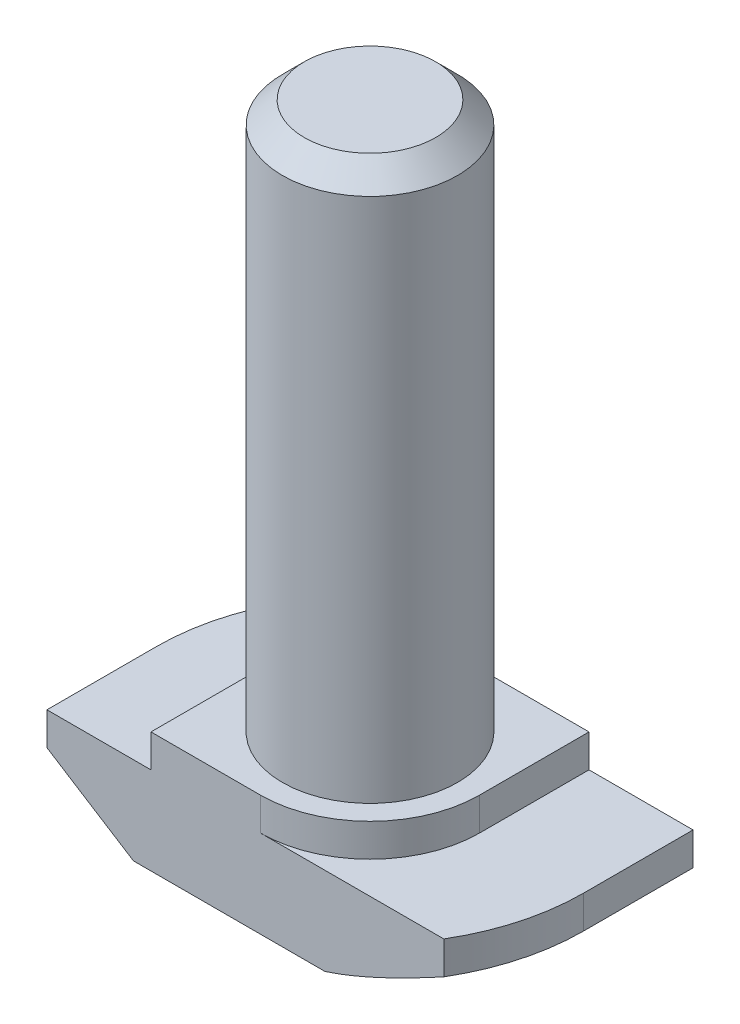
ISO-10303-21;
HEADER;
FILE_DESCRIPTION(('STEP AP214'),'2;1');
FILE_NAME('part.step','',(''),(''),'','','');
FILE_SCHEMA(('AUTOMOTIVE_DESIGN { 1 0 10303 214 1 1 1 1 }'));
ENDSEC;
DATA;
#1=APPLICATION_CONTEXT('core data for automotive mechanical design processes');
#2=APPLICATION_PROTOCOL_DEFINITION('international standard','automotive_design',2000,#1);
#3=PRODUCT_CONTEXT('',#1,'mechanical');
#4=PRODUCT('Part','Part','',(#3));
#5=PRODUCT_RELATED_PRODUCT_CATEGORY('part','',(#4));
#6=PRODUCT_DEFINITION_FORMATION('','',#4);
#7=PRODUCT_DEFINITION_CONTEXT('part definition',#1,'design');
#8=PRODUCT_DEFINITION('design','',#6,#7);
#9=PRODUCT_DEFINITION_SHAPE('','',#8);
#10=(LENGTH_UNIT() NAMED_UNIT(*) SI_UNIT(.MILLI.,.METRE.));
#11=(NAMED_UNIT(*) PLANE_ANGLE_UNIT() SI_UNIT($,.RADIAN.));
#12=(NAMED_UNIT(*) SI_UNIT($,.STERADIAN.) SOLID_ANGLE_UNIT());
#13=UNCERTAINTY_MEASURE_WITH_UNIT(LENGTH_MEASURE(1.E-05),#10,'distance_accuracy_value','');
#14=(GEOMETRIC_REPRESENTATION_CONTEXT(3) GLOBAL_UNCERTAINTY_ASSIGNED_CONTEXT((#13)) GLOBAL_UNIT_ASSIGNED_CONTEXT((#10,
#11,#12)) REPRESENTATION_CONTEXT('',''));
#15=CARTESIAN_POINT('',(0.,0.,0.));
#16=DIRECTION('',(0.,0.,1.));
#17=DIRECTION('',(1.,0.,0.));
#18=AXIS2_PLACEMENT_3D('',#15,#16,#17);
#19=CARTESIAN_POINT('',(-9.75,0.,5.));
#20=DIRECTION('',(1.,0.,0.));
#21=DIRECTION('',(0.,0.,-1.));
#22=AXIS2_PLACEMENT_3D('',#19,#20,#21);
#23=PLANE('',#22);
#24=DIRECTION('',(0.,0.,-1.));
#25=VECTOR('',#24,1.);
#26=CARTESIAN_POINT('',(-9.75,2.5,5.));
#27=LINE('',#26,#25);
#28=CARTESIAN_POINT('',(-9.75,2.5,5.));
#29=VERTEX_POINT('',#28);
#30=CARTESIAN_POINT('',(-9.75,2.5,0.));
#31=VERTEX_POINT('',#30);
#32=EDGE_CURVE('E372',#29,#31,#27,.T.);
#33=ORIENTED_EDGE('',*,*,#32,.F.);
#34=DIRECTION('',(0.,-1.,0.));
#35=VECTOR('',#34,1.);
#36=CARTESIAN_POINT('',(-9.75,0.,5.));
#37=LINE('',#36,#35);
#38=CARTESIAN_POINT('',(-9.75,4.,5.));
#39=VERTEX_POINT('',#38);
#40=EDGE_CURVE('E209',#39,#29,#37,.T.);
#41=ORIENTED_EDGE('',*,*,#40,.F.);
#42=DIRECTION('',(0.,0.,-1.));
#43=VECTOR('',#42,1.);
#44=CARTESIAN_POINT('',(-9.75,4.,5.));
#45=LINE('',#44,#43);
#46=CARTESIAN_POINT('',(-9.75,4.,0.));
#47=VERTEX_POINT('',#46);
#48=EDGE_CURVE('E224',#39,#47,#45,.T.);
#49=ORIENTED_EDGE('',*,*,#48,.T.);
#50=DIRECTION('',(0.,1.,0.));
#51=VECTOR('',#50,1.);
#52=CARTESIAN_POINT('',(-9.75,0.,0.));
#53=LINE('',#52,#51);
#54=EDGE_CURVE('E190',#31,#47,#53,.T.);
#55=ORIENTED_EDGE('',*,*,#54,.F.);
#56=EDGE_LOOP('',(#33,#41,#49,#55));
#57=FACE_BOUND('',#56,.T.);
#58=ADVANCED_FACE('F37',(#57),#23,.F.);
#59=CARTESIAN_POINT('',(9.75,0.,5.));
#60=DIRECTION('',(0.,1.,0.));
#61=DIRECTION('',(0.,0.,1.));
#62=AXIS2_PLACEMENT_3D('',#59,#60,#61);
#63=PLANE('',#62);
#64=DIRECTION('',(1.,0.,0.));
#65=VECTOR('',#64,1.);
#66=CARTESIAN_POINT('',(9.75,0.,5.));
#67=LINE('',#66,#65);
#68=CARTESIAN_POINT('',(-5.8,0.,5.));
#69=VERTEX_POINT('',#68);
#70=CARTESIAN_POINT('',(2.93938769133981,0.,5.));
#71=VERTEX_POINT('',#70);
#72=EDGE_CURVE('E212',#69,#71,#67,.T.);
#73=ORIENTED_EDGE('',*,*,#72,.F.);
#74=DIRECTION('',(0.,0.,-1.));
#75=VECTOR('',#74,1.);
#76=CARTESIAN_POINT('',(-5.8,0.,5.));
#77=LINE('',#76,#75);
#78=CARTESIAN_POINT('',(-5.8,0.,0.));
#79=VERTEX_POINT('',#78);
#80=EDGE_CURVE('E375',#69,#79,#77,.T.);
#81=ORIENTED_EDGE('',*,*,#80,.T.);
#82=CARTESIAN_POINT('',(0.,0.,0.));
#83=DIRECTION('',(0.,-1.,0.));
#84=DIRECTION('',(-1.,0.,0.));
#85=AXIS2_PLACEMENT_3D('',#82,#83,#84);
#86=CIRCLE('',#85,5.8);
#87=CARTESIAN_POINT('',(-2.93938769133982,0.,-5.));
#88=VERTEX_POINT('',#87);
#89=EDGE_CURVE('E385',#79,#88,#86,.T.);
#90=ORIENTED_EDGE('',*,*,#89,.T.);
#91=DIRECTION('',(1.,0.,0.));
#92=VECTOR('',#91,1.);
#93=CARTESIAN_POINT('',(9.75,0.,-5.));
#94=LINE('',#93,#92);
#95=CARTESIAN_POINT('',(5.8,0.,-5.));
#96=VERTEX_POINT('',#95);
#97=EDGE_CURVE('E208',#88,#96,#94,.T.);
#98=ORIENTED_EDGE('',*,*,#97,.T.);
#99=DIRECTION('',(0.,0.,1.));
#100=VECTOR('',#99,1.);
#101=CARTESIAN_POINT('',(5.8,0.,-9.75));
#102=LINE('',#101,#100);
#103=CARTESIAN_POINT('',(5.8,0.,0.));
#104=VERTEX_POINT('',#103);
#105=EDGE_CURVE('E53',#96,#104,#102,.T.);
#106=ORIENTED_EDGE('',*,*,#105,.T.);
#107=CARTESIAN_POINT('',(0.,0.,0.));
#108=DIRECTION('',(0.,-1.,0.));
#109=DIRECTION('',(1.,0.,0.));
#110=AXIS2_PLACEMENT_3D('',#107,#108,#109);
#111=CIRCLE('',#110,5.8);
#112=EDGE_CURVE('E153',#104,#71,#111,.T.);
#113=ORIENTED_EDGE('',*,*,#112,.T.);
#114=EDGE_LOOP('',(#73,#81,#90,#98,#106,#113));
#115=FACE_BOUND('',#114,.T.);
#116=ADVANCED_FACE('F270',(#115),#63,.F.);
#117=CARTESIAN_POINT('',(9.75,0.,5.));
#118=DIRECTION('',(-1.,0.,0.));
#119=DIRECTION('',(0.,0.,1.));
#120=AXIS2_PLACEMENT_3D('',#117,#118,#119);
#121=PLANE('',#120);
#122=DIRECTION('',(0.,0.,1.));
#123=VECTOR('',#122,1.);
#124=CARTESIAN_POINT('',(9.75,2.5,-9.75));
#125=LINE('',#124,#123);
#126=CARTESIAN_POINT('',(9.75,2.5,-5.));
#127=VERTEX_POINT('',#126);
#128=CARTESIAN_POINT('',(9.75,2.5,0.));
#129=VERTEX_POINT('',#128);
#130=EDGE_CURVE('E145',#127,#129,#125,.T.);
#131=ORIENTED_EDGE('',*,*,#130,.F.);
#132=DIRECTION('',(0.,1.,0.));
#133=VECTOR('',#132,1.);
#134=CARTESIAN_POINT('',(9.75,0.,-5.));
#135=LINE('',#134,#133);
#136=CARTESIAN_POINT('',(9.75,4.,-5.));
#137=VERTEX_POINT('',#136);
#138=EDGE_CURVE('E227',#127,#137,#135,.T.);
#139=ORIENTED_EDGE('',*,*,#138,.T.);
#140=DIRECTION('',(0.,0.,-1.));
#141=VECTOR('',#140,1.);
#142=CARTESIAN_POINT('',(9.75,4.,5.));
#143=LINE('',#142,#141);
#144=CARTESIAN_POINT('',(9.75,4.,0.));
#145=VERTEX_POINT('',#144);
#146=EDGE_CURVE('E173',#145,#137,#143,.T.);
#147=ORIENTED_EDGE('',*,*,#146,.F.);
#148=DIRECTION('',(0.,1.,0.));
#149=VECTOR('',#148,1.);
#150=CARTESIAN_POINT('',(9.75,0.,0.));
#151=LINE('',#150,#149);
#152=EDGE_CURVE('E166',#129,#145,#151,.T.);
#153=ORIENTED_EDGE('',*,*,#152,.F.);
#154=EDGE_LOOP('',(#131,#139,#147,#153));
#155=FACE_BOUND('',#154,.T.);
#156=ADVANCED_FACE('F171',(#155),#121,.F.);
#157=CARTESIAN_POINT('',(0.,0.,5.));
#158=DIRECTION('',(0.,0.,-1.));
#159=DIRECTION('',(-1.,0.,0.));
#160=AXIS2_PLACEMENT_3D('',#157,#158,#159);
#161=PLANE('',#160);
#162=DIRECTION('',(-0.844980197489509,0.534797593347791,0.));
#163=VECTOR('',#162,1.);
#164=CARTESIAN_POINT('',(-9.75,2.5,5.));
#165=LINE('',#164,#163);
#166=EDGE_CURVE('E373',#69,#29,#165,.T.);
#167=ORIENTED_EDGE('',*,*,#166,.F.);
#168=ORIENTED_EDGE('',*,*,#72,.T.);
#169=CARTESIAN_POINT('',(8.3710345213916,2.50038035044416,5.));
#170=CARTESIAN_POINT('',(8.14485503763147,2.37751255056509,5.));
#171=CARTESIAN_POINT('',(7.91814414436424,2.25560825185528,5.));
#172=CARTESIAN_POINT('',(7.46336802856226,2.01427419874183,5.));
#173=CARTESIAN_POINT('',(7.23530261352057,1.89484480745523,5.));
#174=CARTESIAN_POINT('',(6.77658273225198,1.65852444966252,5.));
#175=CARTESIAN_POINT('',(6.54592128446781,1.54164699581211,5.));
#176=CARTESIAN_POINT('',(6.08267383878011,1.31178770374963,5.));
#177=CARTESIAN_POINT('',(5.85008793878494,1.19880566884712,5.));
#178=CARTESIAN_POINT('',(5.38850045895099,0.980602867779513,5.));
#179=CARTESIAN_POINT('',(5.1595578408824,0.875257869563463,5.));
#180=CARTESIAN_POINT('',(4.69895239023341,0.670592548807996,5.));
#181=CARTESIAN_POINT('',(4.46728928872485,0.571272827972461,5.));
#182=CARTESIAN_POINT('',(4.00108707979834,0.38059166900738,5.));
#183=CARTESIAN_POINT('',(3.76655273287754,0.289218677543095,5.));
#184=CARTESIAN_POINT('',(3.29379614776259,0.116644148005836,5.));
#185=CARTESIAN_POINT('',(3.05557490729072,0.0354399103972046,5.));
#186=CARTESIAN_POINT('',(2.58854667138869,-0.109582099168053,5.));
#187=CARTESIAN_POINT('',(2.35996631966938,-0.174122082532671,5.));
#188=CARTESIAN_POINT('',(1.89919260818542,-0.288382603381046,5.));
#189=CARTESIAN_POINT('',(1.66700173473846,-0.33811290172539,5.));
#190=CARTESIAN_POINT('',(1.31509928874305,-0.399489564391158,5.));
#191=CARTESIAN_POINT('',(1.19653459621012,-0.417808799856712,5.));
#192=CARTESIAN_POINT('',(0.958746309721246,-0.449516897628666,5.));
#193=CARTESIAN_POINT('',(0.839522754036867,-0.462906043317658,5.));
#194=CARTESIAN_POINT('',(0.600273143638718,-0.484487035929079,5.));
#195=CARTESIAN_POINT('',(0.480245784105953,-0.492664504258673,5.));
#196=CARTESIAN_POINT('',(0.239914647066935,-0.50360257514633,5.));
#197=CARTESIAN_POINT('',(0.119610806307569,-0.506361781459069,5.));
#198=CARTESIAN_POINT('',(-0.000700000000000271,-0.506329082911393,5.));
#199=B_SPLINE_CURVE_WITH_KNOTS('',3,(#169,#170,#171,#172,#173,#174,#175,#176,#177,#178,#179,
#180,#181,#182,#183,#184,#185,#186,#187,#188,#189,#190,#191,#192,#193,#194,#195,#196,#197,#198),
.UNSPECIFIED.,.F.,.F.,(4,2,2,2,2,2,2,2,2,2,2,2,2,2,4),(0.,0.772201750738158,1.54451600760777,
2.32023520866627,3.09591518399236,3.85189775311528,4.60795569327251,5.36289539506572,
6.1176342534965,6.82981297940338,7.54152127390794,7.90134934767844,8.26115673522602,
8.62195255315834,8.98284133326183),.UNSPECIFIED.);
#200=CARTESIAN_POINT('',(8.3703345213916,2.5,5.));
#201=VERTEX_POINT('',#200);
#202=EDGE_CURVE('E318',#201,#71,#199,.T.);
#203=ORIENTED_EDGE('',*,*,#202,.F.);
#204=DIRECTION('',(0.,1.,0.));
#205=VECTOR('',#204,1.);
#206=CARTESIAN_POINT('',(8.3703345213916,0.,5.));
#207=LINE('',#206,#205);
#208=CARTESIAN_POINT('',(8.3703345213916,4.,5.));
#209=VERTEX_POINT('',#208);
#210=EDGE_CURVE('E168',#201,#209,#207,.T.);
#211=ORIENTED_EDGE('',*,*,#210,.T.);
#212=DIRECTION('',(-1.,0.,0.));
#213=VECTOR('',#212,1.);
#214=CARTESIAN_POINT('',(9.75,4.,5.));
#215=LINE('',#214,#213);
#216=CARTESIAN_POINT('',(0.,4.,5.));
#217=VERTEX_POINT('',#216);
#218=EDGE_CURVE('E216',#209,#217,#215,.T.);
#219=ORIENTED_EDGE('',*,*,#218,.T.);
#220=DIRECTION('',(0.,1.,0.));
#221=VECTOR('',#220,1.);
#222=CARTESIAN_POINT('',(0.,-3.07106781186548,5.));
#223=LINE('',#222,#221);
#224=CARTESIAN_POINT('',(0.,5.5,5.));
#225=VERTEX_POINT('',#224);
#226=EDGE_CURVE('E194',#217,#225,#223,.T.);
#227=ORIENTED_EDGE('',*,*,#226,.T.);
#228=DIRECTION('',(-1.,0.,0.));
#229=VECTOR('',#228,1.);
#230=CARTESIAN_POINT('',(-5.,5.5,5.));
#231=LINE('',#230,#229);
#232=CARTESIAN_POINT('',(-5.,5.5,5.));
#233=VERTEX_POINT('',#232);
#234=EDGE_CURVE('E218',#225,#233,#231,.T.);
#235=ORIENTED_EDGE('',*,*,#234,.T.);
#236=DIRECTION('',(0.,-1.,0.));
#237=VECTOR('',#236,1.);
#238=CARTESIAN_POINT('',(-5.,4.,5.));
#239=LINE('',#238,#237);
#240=CARTESIAN_POINT('',(-5.,4.,5.));
#241=VERTEX_POINT('',#240);
#242=EDGE_CURVE('E220',#233,#241,#239,.T.);
#243=ORIENTED_EDGE('',*,*,#242,.T.);
#244=DIRECTION('',(-1.,0.,0.));
#245=VECTOR('',#244,1.);
#246=CARTESIAN_POINT('',(-9.75,4.,5.));
#247=LINE('',#246,#245);
#248=EDGE_CURVE('E222',#241,#39,#247,.T.);
#249=ORIENTED_EDGE('',*,*,#248,.T.);
#250=ORIENTED_EDGE('',*,*,#40,.T.);
#251=EDGE_LOOP('',(#167,#168,#203,#211,#219,#227,#235,#243,#249,#250));
#252=FACE_BOUND('',#251,.T.);
#253=ADVANCED_FACE('F281',(#252),#161,.F.);
#254=CARTESIAN_POINT('',(0.,0.,-5.));
#255=DIRECTION('',(0.,0.,-1.));
#256=DIRECTION('',(-1.,0.,0.));
#257=AXIS2_PLACEMENT_3D('',#254,#255,#256);
#258=PLANE('',#257);
#259=ORIENTED_EDGE('',*,*,#97,.F.);
#260=CARTESIAN_POINT('',(0.00070000000000138,-0.506329082911397,-5.));
#261=CARTESIAN_POINT('',(-0.11492355286762,-0.506358201187866,-5.));
#262=CARTESIAN_POINT('',(-0.230541342283267,-0.503811651701555,-5.));
#263=CARTESIAN_POINT('',(-0.461532910337905,-0.493707507103407,-5.));
#264=CARTESIAN_POINT('',(-0.576906737550149,-0.48615102719651,-5.));
#265=CARTESIAN_POINT('',(-0.806948113963408,-0.466191618236643,-5.));
#266=CARTESIAN_POINT('',(-0.921616700128454,-0.453800577810883,-5.));
#267=CARTESIAN_POINT('',(-1.15036260798101,-0.424427750820964,-5.));
#268=CARTESIAN_POINT('',(-1.26443990025042,-0.407445738038838,-5.));
#269=CARTESIAN_POINT('',(-1.60314096911344,-0.350479262852961,-5.));
#270=CARTESIAN_POINT('',(-1.82673025128966,-0.304244681434307,-5.));
#271=CARTESIAN_POINT('',(-2.27058382288403,-0.197749704270996,-5.));
#272=CARTESIAN_POINT('',(-2.49084621805169,-0.13748161665558,-5.));
#273=CARTESIAN_POINT('',(-2.95448552535975,0.00231900980771354,-5.));
#274=CARTESIAN_POINT('',(-3.19742086780124,0.0833022458753652,-5.));
#275=CARTESIAN_POINT('',(-3.67941522891594,0.256156738222036,-5.));
#276=CARTESIAN_POINT('',(-3.91847303773159,0.348031321223873,-5.));
#277=CARTESIAN_POINT('',(-4.39361886594961,0.540256398970149,-5.));
#278=CARTESIAN_POINT('',(-4.62970092868475,0.640621503905241,-5.));
#279=CARTESIAN_POINT('',(-5.09899519125866,0.847741673465407,-5.));
#280=CARTESIAN_POINT('',(-5.33220771380245,0.95449601149878,-5.));
#281=CARTESIAN_POINT('',(-5.80260552399803,1.17594489337857,-5.));
#282=CARTESIAN_POINT('',(-6.0397260114898,1.29077650765228,-5.));
#283=CARTESIAN_POINT('',(-6.51194869465368,1.52453629386533,-5.));
#284=CARTESIAN_POINT('',(-6.74705077660686,1.6434646947539,-5.));
#285=CARTESIAN_POINT('',(-7.21442387447975,1.88395034865552,-5.));
#286=CARTESIAN_POINT('',(-7.44670315486301,2.00549158860828,-5.));
#287=CARTESIAN_POINT('',(-7.90984974140112,2.25114994882745,-5.));
#288=CARTESIAN_POINT('',(-8.14071726576929,2.37526665727356,-5.));
#289=CARTESIAN_POINT('',(-8.3710345213916,2.50038035044416,-5.));
#290=B_SPLINE_CURVE_WITH_KNOTS('',3,(#260,#261,#262,#263,#264,#265,#266,#267,#268,#269,#270,
#271,#272,#273,#274,#275,#276,#277,#278,#279,#280,#281,#282,#283,#284,#285,#286,#287,#288,#289),
.UNSPECIFIED.,.F.,.F.,(4,2,2,2,2,2,2,2,2,2,2,2,2,2,4),(0.,0.346832601073218,0.693588023504655,
1.03949606304986,1.38542115015583,2.06977108877902,2.75449701140492,3.52238142993095,
4.29050100328089,5.05997031676438,5.82935229087948,6.61968962937037,7.41007120780528,
8.19652251048066,8.98284901326047),.UNSPECIFIED.);
#291=CARTESIAN_POINT('',(-8.3703345213916,2.5,-5.));
#292=VERTEX_POINT('',#291);
#293=EDGE_CURVE('E312',#88,#292,#290,.T.);
#294=ORIENTED_EDGE('',*,*,#293,.T.);
#295=DIRECTION('',(0.,1.,0.));
#296=VECTOR('',#295,1.);
#297=CARTESIAN_POINT('',(-8.3703345213916,0.,-5.));
#298=LINE('',#297,#296);
#299=CARTESIAN_POINT('',(-8.3703345213916,4.,-5.));
#300=VERTEX_POINT('',#299);
#301=EDGE_CURVE('E177',#292,#300,#298,.T.);
#302=ORIENTED_EDGE('',*,*,#301,.T.);
#303=DIRECTION('',(-1.,0.,0.));
#304=VECTOR('',#303,1.);
#305=CARTESIAN_POINT('',(-9.75,4.,-5.));
#306=LINE('',#305,#304);
#307=CARTESIAN_POINT('',(0.,4.,-5.));
#308=VERTEX_POINT('',#307);
#309=EDGE_CURVE('E213',#308,#300,#306,.T.);
#310=ORIENTED_EDGE('',*,*,#309,.F.);
#311=DIRECTION('',(0.,1.,0.));
#312=VECTOR('',#311,1.);
#313=CARTESIAN_POINT('',(0.,-3.07106781186548,-5.));
#314=LINE('',#313,#312);
#315=CARTESIAN_POINT('',(0.,5.5,-5.));
#316=VERTEX_POINT('',#315);
#317=EDGE_CURVE('E204',#308,#316,#314,.T.);
#318=ORIENTED_EDGE('',*,*,#317,.T.);
#319=DIRECTION('',(-1.,0.,0.));
#320=VECTOR('',#319,1.);
#321=CARTESIAN_POINT('',(-5.,5.5,-5.));
#322=LINE('',#321,#320);
#323=CARTESIAN_POINT('',(5.,5.5,-5.));
#324=VERTEX_POINT('',#323);
#325=EDGE_CURVE('E235',#324,#316,#322,.T.);
#326=ORIENTED_EDGE('',*,*,#325,.F.);
#327=DIRECTION('',(0.,1.,0.));
#328=VECTOR('',#327,1.);
#329=CARTESIAN_POINT('',(5.,4.,-5.));
#330=LINE('',#329,#328);
#331=CARTESIAN_POINT('',(5.,4.,-5.));
#332=VERTEX_POINT('',#331);
#333=EDGE_CURVE('E232',#332,#324,#330,.T.);
#334=ORIENTED_EDGE('',*,*,#333,.F.);
#335=DIRECTION('',(-1.,0.,0.));
#336=VECTOR('',#335,1.);
#337=CARTESIAN_POINT('',(9.75,4.,-5.));
#338=LINE('',#337,#336);
#339=EDGE_CURVE('E229',#137,#332,#338,.T.);
#340=ORIENTED_EDGE('',*,*,#339,.F.);
#341=ORIENTED_EDGE('',*,*,#138,.F.);
#342=DIRECTION('',(-0.84498019748951,-0.534797593347791,0.));
#343=VECTOR('',#342,1.);
#344=CARTESIAN_POINT('',(1.65884910193342,-2.6209815810548,-5.));
#345=LINE('',#344,#343);
#346=EDGE_CURVE('E149',#127,#96,#345,.T.);
#347=ORIENTED_EDGE('',*,*,#346,.T.);
#348=EDGE_LOOP('',(#259,#294,#302,#310,#318,#326,#334,#340,#341,#347));
#349=FACE_BOUND('',#348,.T.);
#350=ADVANCED_FACE('F303',(#349),#258,.T.);
#351=CARTESIAN_POINT('',(0.,0.,0.));
#352=DIRECTION('',(0.,1.,0.));
#353=DIRECTION('',(0.,0.,1.));
#354=AXIS2_PLACEMENT_3D('',#351,#352,#353);
#355=CYLINDRICAL_SURFACE('',#354,9.75);
#356=CARTESIAN_POINT('',(0.,2.5,0.));
#357=DIRECTION('',(0.,-1.,0.));
#358=DIRECTION('',(-1.,0.,0.));
#359=AXIS2_PLACEMENT_3D('',#356,#357,#358);
#360=CIRCLE('',#359,9.75);
#361=EDGE_CURVE('E61',#31,#292,#360,.T.);
#362=ORIENTED_EDGE('',*,*,#361,.F.);
#363=ORIENTED_EDGE('',*,*,#54,.T.);
#364=CARTESIAN_POINT('',(0.,4.,0.));
#365=DIRECTION('',(0.,-1.,0.));
#366=DIRECTION('',(0.,0.,-1.));
#367=AXIS2_PLACEMENT_3D('',#364,#365,#366);
#368=CIRCLE('',#367,9.75);
#369=EDGE_CURVE('E174',#47,#300,#368,.T.);
#370=ORIENTED_EDGE('',*,*,#369,.T.);
#371=ORIENTED_EDGE('',*,*,#301,.F.);
#372=EDGE_LOOP('',(#362,#363,#370,#371));
#373=FACE_BOUND('',#372,.T.);
#374=ADVANCED_FACE('F307',(#373),#355,.T.);
#375=CARTESIAN_POINT('',(0.,0.,0.));
#376=DIRECTION('',(0.,1.,0.));
#377=DIRECTION('',(0.,0.,1.));
#378=AXIS2_PLACEMENT_3D('',#375,#376,#377);
#379=CYLINDRICAL_SURFACE('',#378,9.75);
#380=CARTESIAN_POINT('',(0.,2.5,0.));
#381=DIRECTION('',(0.,-1.,0.));
#382=DIRECTION('',(1.,0.,0.));
#383=AXIS2_PLACEMENT_3D('',#380,#381,#382);
#384=CIRCLE('',#383,9.75);
#385=EDGE_CURVE('E158',#129,#201,#384,.T.);
#386=ORIENTED_EDGE('',*,*,#385,.F.);
#387=ORIENTED_EDGE('',*,*,#152,.T.);
#388=CARTESIAN_POINT('',(0.,4.,0.));
#389=DIRECTION('',(0.,-1.,0.));
#390=DIRECTION('',(0.,0.,-1.));
#391=AXIS2_PLACEMENT_3D('',#388,#389,#390);
#392=CIRCLE('',#391,9.75);
#393=EDGE_CURVE('E179',#145,#209,#392,.T.);
#394=ORIENTED_EDGE('',*,*,#393,.T.);
#395=ORIENTED_EDGE('',*,*,#210,.F.);
#396=EDGE_LOOP('',(#386,#387,#394,#395));
#397=FACE_BOUND('',#396,.T.);
#398=ADVANCED_FACE('F164',(#397),#379,.T.);
#399=CARTESIAN_POINT('',(-5.,5.5,5.));
#400=DIRECTION('',(0.,-1.,0.));
#401=DIRECTION('',(0.,0.,-1.));
#402=AXIS2_PLACEMENT_3D('',#399,#400,#401);
#403=PLANE('',#402);
#404=CARTESIAN_POINT('',(0.,5.5,0.));
#405=DIRECTION('',(0.,1.,0.));
#406=DIRECTION('',(0.,0.,1.));
#407=AXIS2_PLACEMENT_3D('',#404,#405,#406);
#408=CIRCLE('',#407,4.);
#409=CARTESIAN_POINT('',(0.,5.5,4.));
#410=VERTEX_POINT('',#409);
#411=EDGE_CURVE('E184',#410,#410,#408,.T.);
#412=ORIENTED_EDGE('',*,*,#411,.F.);
#413=EDGE_LOOP('',(#412));
#414=FACE_BOUND('',#413,.T.);
#415=ORIENTED_EDGE('',*,*,#234,.F.);
#416=CARTESIAN_POINT('',(0.,5.5,0.));
#417=DIRECTION('',(0.,-1.,0.));
#418=DIRECTION('',(0.,0.,-1.));
#419=AXIS2_PLACEMENT_3D('',#416,#417,#418);
#420=CIRCLE('',#419,5.);
#421=CARTESIAN_POINT('',(5.,5.5,0.));
#422=VERTEX_POINT('',#421);
#423=EDGE_CURVE('E187',#422,#225,#420,.T.);
#424=ORIENTED_EDGE('',*,*,#423,.F.);
#425=DIRECTION('',(0.,0.,-1.));
#426=VECTOR('',#425,1.);
#427=CARTESIAN_POINT('',(5.,5.5,5.));
#428=LINE('',#427,#426);
#429=EDGE_CURVE('E248',#422,#324,#428,.T.);
#430=ORIENTED_EDGE('',*,*,#429,.T.);
#431=ORIENTED_EDGE('',*,*,#325,.T.);
#432=CARTESIAN_POINT('',(0.,5.5,0.));
#433=DIRECTION('',(0.,-1.,0.));
#434=DIRECTION('',(0.,0.,-1.));
#435=AXIS2_PLACEMENT_3D('',#432,#433,#434);
#436=CIRCLE('',#435,5.);
#437=CARTESIAN_POINT('',(-5.,5.5,0.));
#438=VERTEX_POINT('',#437);
#439=EDGE_CURVE('E198',#438,#316,#436,.T.);
#440=ORIENTED_EDGE('',*,*,#439,.F.);
#441=DIRECTION('',(0.,0.,-1.));
#442=VECTOR('',#441,1.);
#443=CARTESIAN_POINT('',(-5.,5.5,5.));
#444=LINE('',#443,#442);
#445=EDGE_CURVE('E245',#233,#438,#444,.T.);
#446=ORIENTED_EDGE('',*,*,#445,.F.);
#447=EDGE_LOOP('',(#415,#424,#430,#431,#440,#446));
#448=FACE_BOUND('',#447,.T.);
#449=ADVANCED_FACE('F286',(#414,#448),#403,.F.);
#450=CARTESIAN_POINT('',(9.75,4.,5.));
#451=DIRECTION('',(0.,-1.,0.));
#452=DIRECTION('',(0.,0.,-1.));
#453=AXIS2_PLACEMENT_3D('',#450,#451,#452);
#454=PLANE('',#453);
#455=ORIENTED_EDGE('',*,*,#218,.F.);
#456=ORIENTED_EDGE('',*,*,#393,.F.);
#457=ORIENTED_EDGE('',*,*,#146,.T.);
#458=ORIENTED_EDGE('',*,*,#339,.T.);
#459=DIRECTION('',(0.,0.,-1.));
#460=VECTOR('',#459,1.);
#461=CARTESIAN_POINT('',(5.,4.,5.));
#462=LINE('',#461,#460);
#463=CARTESIAN_POINT('',(5.,4.,0.));
#464=VERTEX_POINT('',#463);
#465=EDGE_CURVE('E250',#464,#332,#462,.T.);
#466=ORIENTED_EDGE('',*,*,#465,.F.);
#467=CARTESIAN_POINT('',(0.,4.,0.));
#468=DIRECTION('',(0.,-1.,0.));
#469=DIRECTION('',(0.,0.,-1.));
#470=AXIS2_PLACEMENT_3D('',#467,#468,#469);
#471=CIRCLE('',#470,5.);
#472=EDGE_CURVE('E191',#464,#217,#471,.T.);
#473=ORIENTED_EDGE('',*,*,#472,.T.);
#474=EDGE_LOOP('',(#455,#456,#457,#458,#466,#473));
#475=FACE_BOUND('',#474,.T.);
#476=ADVANCED_FACE('F282',(#475),#454,.F.);
#477=CARTESIAN_POINT('',(5.,4.,5.));
#478=DIRECTION('',(-1.,0.,0.));
#479=DIRECTION('',(0.,0.,1.));
#480=AXIS2_PLACEMENT_3D('',#477,#478,#479);
#481=PLANE('',#480);
#482=ORIENTED_EDGE('',*,*,#429,.F.);
#483=DIRECTION('',(0.,1.,0.));
#484=VECTOR('',#483,1.);
#485=CARTESIAN_POINT('',(5.,-3.07106781186548,0.));
#486=LINE('',#485,#484);
#487=EDGE_CURVE('E189',#464,#422,#486,.T.);
#488=ORIENTED_EDGE('',*,*,#487,.F.);
#489=ORIENTED_EDGE('',*,*,#465,.T.);
#490=ORIENTED_EDGE('',*,*,#333,.T.);
#491=EDGE_LOOP('',(#482,#488,#489,#490));
#492=FACE_BOUND('',#491,.T.);
#493=ADVANCED_FACE('F285',(#492),#481,.F.);
#494=CARTESIAN_POINT('',(-5.,4.,5.));
#495=DIRECTION('',(1.,0.,0.));
#496=DIRECTION('',(0.,0.,-1.));
#497=AXIS2_PLACEMENT_3D('',#494,#495,#496);
#498=PLANE('',#497);
#499=ORIENTED_EDGE('',*,*,#445,.T.);
#500=DIRECTION('',(0.,1.,0.));
#501=VECTOR('',#500,1.);
#502=CARTESIAN_POINT('',(-5.,-3.07106781186548,0.));
#503=LINE('',#502,#501);
#504=CARTESIAN_POINT('',(-5.,4.,0.));
#505=VERTEX_POINT('',#504);
#506=EDGE_CURVE('E200',#505,#438,#503,.T.);
#507=ORIENTED_EDGE('',*,*,#506,.F.);
#508=DIRECTION('',(0.,0.,-1.));
#509=VECTOR('',#508,1.);
#510=CARTESIAN_POINT('',(-5.,4.,5.));
#511=LINE('',#510,#509);
#512=EDGE_CURVE('E242',#241,#505,#511,.T.);
#513=ORIENTED_EDGE('',*,*,#512,.F.);
#514=ORIENTED_EDGE('',*,*,#242,.F.);
#515=EDGE_LOOP('',(#499,#507,#513,#514));
#516=FACE_BOUND('',#515,.T.);
#517=ADVANCED_FACE('F290',(#516),#498,.F.);
#518=CARTESIAN_POINT('',(-9.75,4.,5.));
#519=DIRECTION('',(0.,-1.,0.));
#520=DIRECTION('',(0.,0.,-1.));
#521=AXIS2_PLACEMENT_3D('',#518,#519,#520);
#522=PLANE('',#521);
#523=ORIENTED_EDGE('',*,*,#309,.T.);
#524=ORIENTED_EDGE('',*,*,#369,.F.);
#525=ORIENTED_EDGE('',*,*,#48,.F.);
#526=ORIENTED_EDGE('',*,*,#248,.F.);
#527=ORIENTED_EDGE('',*,*,#512,.T.);
#528=CARTESIAN_POINT('',(0.,4.,0.));
#529=DIRECTION('',(0.,-1.,0.));
#530=DIRECTION('',(0.,0.,-1.));
#531=AXIS2_PLACEMENT_3D('',#528,#529,#530);
#532=CIRCLE('',#531,5.);
#533=EDGE_CURVE('E201',#505,#308,#532,.T.);
#534=ORIENTED_EDGE('',*,*,#533,.T.);
#535=EDGE_LOOP('',(#523,#524,#525,#526,#527,#534));
#536=FACE_BOUND('',#535,.T.);
#537=ADVANCED_FACE('F297',(#536),#522,.F.);
#538=CARTESIAN_POINT('',(0.,-3.07106781186548,0.));
#539=DIRECTION('',(0.,1.,0.));
#540=DIRECTION('',(0.,0.,1.));
#541=AXIS2_PLACEMENT_3D('',#538,#539,#540);
#542=CYLINDRICAL_SURFACE('',#541,5.);
#543=ORIENTED_EDGE('',*,*,#506,.T.);
#544=ORIENTED_EDGE('',*,*,#439,.T.);
#545=ORIENTED_EDGE('',*,*,#317,.F.);
#546=ORIENTED_EDGE('',*,*,#533,.F.);
#547=EDGE_LOOP('',(#543,#544,#545,#546));
#548=FACE_BOUND('',#547,.T.);
#549=ADVANCED_FACE('F301',(#548),#542,.T.);
#550=CARTESIAN_POINT('',(0.,-3.07106781186548,0.));
#551=DIRECTION('',(0.,1.,0.));
#552=DIRECTION('',(0.,0.,1.));
#553=AXIS2_PLACEMENT_3D('',#550,#551,#552);
#554=CYLINDRICAL_SURFACE('',#553,5.);
#555=ORIENTED_EDGE('',*,*,#487,.T.);
#556=ORIENTED_EDGE('',*,*,#423,.T.);
#557=ORIENTED_EDGE('',*,*,#226,.F.);
#558=ORIENTED_EDGE('',*,*,#472,.F.);
#559=EDGE_LOOP('',(#555,#556,#557,#558));
#560=FACE_BOUND('',#559,.T.);
#561=ADVANCED_FACE('F339',(#560),#554,.T.);
#562=CARTESIAN_POINT('',(0.,30.5,0.));
#563=DIRECTION('',(0.,-1.,0.));
#564=DIRECTION('',(0.,0.,-1.));
#565=AXIS2_PLACEMENT_3D('',#562,#563,#564);
#566=CYLINDRICAL_SURFACE('',#565,4.);
#567=CARTESIAN_POINT('',(0.,29.5,0.));
#568=DIRECTION('',(0.,1.,0.));
#569=DIRECTION('',(0.,0.,1.));
#570=AXIS2_PLACEMENT_3D('',#567,#568,#569);
#571=CIRCLE('',#570,4.);
#572=CARTESIAN_POINT('',(0.,29.5,4.));
#573=VERTEX_POINT('',#572);
#574=EDGE_CURVE('E11',#573,#573,#571,.F.);
#575=ORIENTED_EDGE('',*,*,#574,.T.);
#576=EDGE_LOOP('',(#575));
#577=FACE_BOUND('',#576,.T.);
#578=ORIENTED_EDGE('',*,*,#411,.T.);
#579=EDGE_LOOP('',(#578));
#580=FACE_BOUND('',#579,.T.);
#581=ADVANCED_FACE('F336',(#577,#580),#566,.T.);
#582=CARTESIAN_POINT('',(0.,30.5,0.));
#583=DIRECTION('',(0.,1.,0.));
#584=DIRECTION('',(0.,0.,1.));
#585=AXIS2_PLACEMENT_3D('',#582,#583,#584);
#586=PLANE('',#585);
#587=CARTESIAN_POINT('',(0.,30.5,0.));
#588=DIRECTION('',(0.,1.,0.));
#589=DIRECTION('',(0.,0.,1.));
#590=AXIS2_PLACEMENT_3D('',#587,#588,#589);
#591=CIRCLE('',#590,3.);
#592=CARTESIAN_POINT('',(0.,30.5,3.));
#593=VERTEX_POINT('',#592);
#594=EDGE_CURVE('E46',#593,#593,#591,.T.);
#595=ORIENTED_EDGE('',*,*,#594,.T.);
#596=EDGE_LOOP('',(#595));
#597=FACE_BOUND('',#596,.T.);
#598=ADVANCED_FACE('F255',(#597),#586,.T.);
#599=CARTESIAN_POINT('',(9.75,2.5,-9.75));
#600=DIRECTION('',(0.534797593347791,-0.84498019748951,0.));
#601=DIRECTION('',(0.84498019748951,0.534797593347791,0.));
#602=AXIS2_PLACEMENT_3D('',#599,#600,#601);
#603=PLANE('',#602);
#604=ORIENTED_EDGE('',*,*,#130,.T.);
#605=DIRECTION('',(0.844980197489509,0.534797593347791,0.));
#606=VECTOR('',#605,1.);
#607=CARTESIAN_POINT('',(9.75,2.5,0.));
#608=LINE('',#607,#606);
#609=EDGE_CURVE('E148',#104,#129,#608,.T.);
#610=ORIENTED_EDGE('',*,*,#609,.F.);
#611=ORIENTED_EDGE('',*,*,#105,.F.);
#612=ORIENTED_EDGE('',*,*,#346,.F.);
#613=EDGE_LOOP('',(#604,#610,#611,#612));
#614=FACE_BOUND('',#613,.T.);
#615=ADVANCED_FACE('F147',(#614),#603,.T.);
#616=CARTESIAN_POINT('',(0.,0.,0.));
#617=DIRECTION('',(0.,1.,0.));
#618=DIRECTION('',(0.,0.,1.));
#619=AXIS2_PLACEMENT_3D('',#616,#617,#618);
#620=CONICAL_SURFACE('',#619,5.8,1.00652813793696);
#621=ORIENTED_EDGE('',*,*,#202,.T.);
#622=ORIENTED_EDGE('',*,*,#112,.F.);
#623=ORIENTED_EDGE('',*,*,#609,.T.);
#624=ORIENTED_EDGE('',*,*,#385,.T.);
#625=EDGE_LOOP('',(#621,#622,#623,#624));
#626=FACE_BOUND('',#625,.T.);
#627=ADVANCED_FACE('F157',(#626),#620,.T.);
#628=CARTESIAN_POINT('',(-9.75,2.5,5.));
#629=DIRECTION('',(-0.534797593347791,-0.844980197489509,0.));
#630=DIRECTION('',(0.84498019748951,-0.534797593347791,0.));
#631=AXIS2_PLACEMENT_3D('',#628,#629,#630);
#632=PLANE('',#631);
#633=ORIENTED_EDGE('',*,*,#32,.T.);
#634=DIRECTION('',(-0.844980197489509,0.534797593347791,0.));
#635=VECTOR('',#634,1.);
#636=CARTESIAN_POINT('',(-9.75,2.5,0.));
#637=LINE('',#636,#635);
#638=EDGE_CURVE('E382',#79,#31,#637,.T.);
#639=ORIENTED_EDGE('',*,*,#638,.F.);
#640=ORIENTED_EDGE('',*,*,#80,.F.);
#641=ORIENTED_EDGE('',*,*,#166,.T.);
#642=EDGE_LOOP('',(#633,#639,#640,#641));
#643=FACE_BOUND('',#642,.T.);
#644=ADVANCED_FACE('F260',(#643),#632,.T.);
#645=CARTESIAN_POINT('',(0.,0.,0.));
#646=DIRECTION('',(0.,1.,0.));
#647=DIRECTION('',(0.,0.,1.));
#648=AXIS2_PLACEMENT_3D('',#645,#646,#647);
#649=CONICAL_SURFACE('',#648,5.8,1.00652813793696);
#650=ORIENTED_EDGE('',*,*,#89,.F.);
#651=ORIENTED_EDGE('',*,*,#638,.T.);
#652=ORIENTED_EDGE('',*,*,#361,.T.);
#653=ORIENTED_EDGE('',*,*,#293,.F.);
#654=EDGE_LOOP('',(#650,#651,#652,#653));
#655=FACE_BOUND('',#654,.T.);
#656=ADVANCED_FACE('F258',(#655),#649,.T.);
#657=CARTESIAN_POINT('',(0.,30.5,0.));
#658=DIRECTION('',(0.,-1.,0.));
#659=DIRECTION('',(0.,0.,-1.));
#660=AXIS2_PLACEMENT_3D('',#657,#658,#659);
#661=CONICAL_SURFACE('',#660,3.,0.785398163397447);
#662=ORIENTED_EDGE('',*,*,#574,.F.);
#663=EDGE_LOOP('',(#662));
#664=FACE_BOUND('',#663,.T.);
#665=ORIENTED_EDGE('',*,*,#594,.F.);
#666=EDGE_LOOP('',(#665));
#667=FACE_BOUND('',#666,.T.);
#668=ADVANCED_FACE('F40',(#664,#667),#661,.T.);
#669=CLOSED_SHELL('',(#58,#116,#156,#253,#350,#374,#398,#449,#476,#493,#517,#537,#549,#561,#581,
#598,#615,#627,#644,#656,#668));
#670=MANIFOLD_SOLID_BREP('B2',#669);
#671=ADVANCED_BREP_SHAPE_REPRESENTATION('',(#18,#670),#14);
#672=SHAPE_DEFINITION_REPRESENTATION(#9,#671);
ENDSEC;
END-ISO-10303-21;
